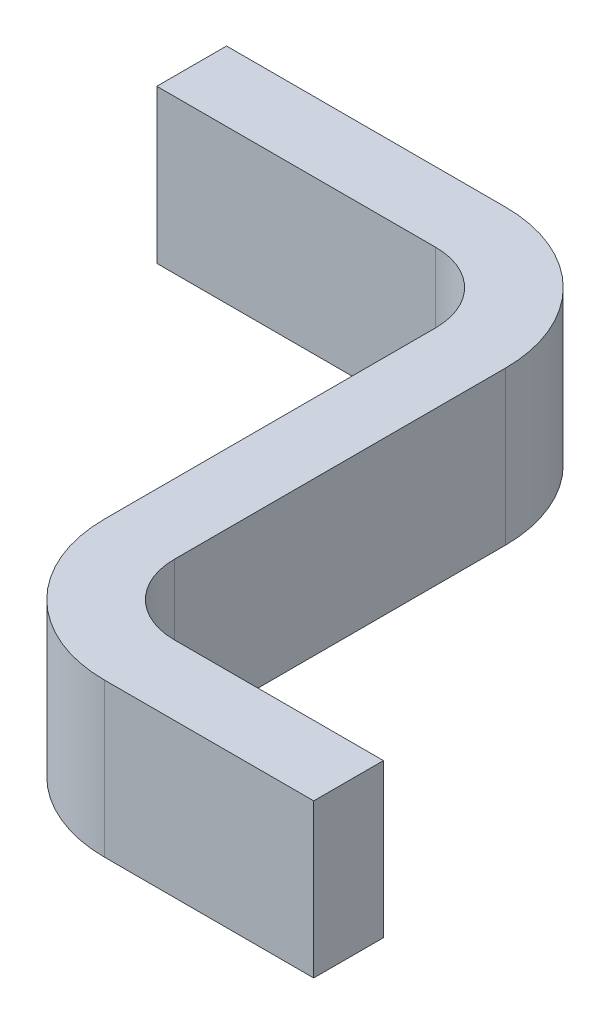
ISO-10303-21;
HEADER;
FILE_DESCRIPTION(('STEP AP214'),'2;1');
FILE_NAME('part.step','',(''),(''),'','','');
FILE_SCHEMA(('AUTOMOTIVE_DESIGN { 1 0 10303 214 1 1 1 1 }'));
ENDSEC;
DATA;
#1=APPLICATION_CONTEXT('core data for automotive mechanical design processes');
#2=APPLICATION_PROTOCOL_DEFINITION('international standard','automotive_design',2000,#1);
#3=PRODUCT_CONTEXT('',#1,'mechanical');
#4=PRODUCT('Part','Part','',(#3));
#5=PRODUCT_RELATED_PRODUCT_CATEGORY('part','',(#4));
#6=PRODUCT_DEFINITION_FORMATION('','',#4);
#7=PRODUCT_DEFINITION_CONTEXT('part definition',#1,'design');
#8=PRODUCT_DEFINITION('design','',#6,#7);
#9=PRODUCT_DEFINITION_SHAPE('','',#8);
#10=(LENGTH_UNIT() NAMED_UNIT(*) SI_UNIT(.MILLI.,.METRE.));
#11=(NAMED_UNIT(*) PLANE_ANGLE_UNIT() SI_UNIT($,.RADIAN.));
#12=(NAMED_UNIT(*) SI_UNIT($,.STERADIAN.) SOLID_ANGLE_UNIT());
#13=UNCERTAINTY_MEASURE_WITH_UNIT(LENGTH_MEASURE(1.E-05),#10,'distance_accuracy_value','');
#14=(GEOMETRIC_REPRESENTATION_CONTEXT(3) GLOBAL_UNCERTAINTY_ASSIGNED_CONTEXT((#13)) GLOBAL_UNIT_ASSIGNED_CONTEXT((#10,
#11,#12)) REPRESENTATION_CONTEXT('',''));
#15=CARTESIAN_POINT('',(0.,0.,0.));
#16=DIRECTION('',(0.,0.,1.));
#17=DIRECTION('',(1.,0.,0.));
#18=AXIS2_PLACEMENT_3D('',#15,#16,#17);
#19=CARTESIAN_POINT('',(-4.,-1.64,0.675));
#20=DIRECTION('',(0.,-1.,0.));
#21=DIRECTION('',(1.,0.,0.));
#22=AXIS2_PLACEMENT_3D('',#19,#20,#21);
#23=PLANE('',#22);
#24=CARTESIAN_POINT('',(-3.8,-1.64,0.675));
#25=DIRECTION('',(0.,1.,0.));
#26=DIRECTION('',(-1.,0.,0.));
#27=AXIS2_PLACEMENT_3D('',#24,#25,#26);
#28=CIRCLE('',#27,0.2);
#29=CARTESIAN_POINT('',(-3.8,-1.64,0.875));
#30=VERTEX_POINT('',#29);
#31=CARTESIAN_POINT('',(-4.,-1.64,0.675));
#32=VERTEX_POINT('',#31);
#33=EDGE_CURVE('E150',#30,#32,#28,.F.);
#34=ORIENTED_EDGE('',*,*,#33,.F.);
#35=DIRECTION('',(-1.,0.,0.));
#36=VECTOR('',#35,1.);
#37=CARTESIAN_POINT('',(-3.50000000000001,-1.64,0.875));
#38=LINE('',#37,#36);
#39=CARTESIAN_POINT('',(-3.50000000000001,-1.64,0.875));
#40=VERTEX_POINT('',#39);
#41=EDGE_CURVE('E147',#30,#40,#38,.F.);
#42=ORIENTED_EDGE('',*,*,#41,.T.);
#43=DIRECTION('',(0.,0.,1.));
#44=VECTOR('',#43,1.);
#45=CARTESIAN_POINT('',(-3.50000000000001,-1.64,0.775));
#46=LINE('',#45,#44);
#47=CARTESIAN_POINT('',(-3.50000000000001,-1.64,0.775));
#48=VERTEX_POINT('',#47);
#49=EDGE_CURVE('E141',#48,#40,#46,.T.);
#50=ORIENTED_EDGE('',*,*,#49,.F.);
#51=DIRECTION('',(1.,0.,0.));
#52=VECTOR('',#51,1.);
#53=CARTESIAN_POINT('',(-3.50000000000001,-1.64,0.775));
#54=LINE('',#53,#52);
#55=CARTESIAN_POINT('',(-3.8,-1.64,0.775));
#56=VERTEX_POINT('',#55);
#57=EDGE_CURVE('E115',#48,#56,#54,.F.);
#58=ORIENTED_EDGE('',*,*,#57,.T.);
#59=CARTESIAN_POINT('',(-3.8,-1.64,0.675));
#60=DIRECTION('',(0.,1.,0.));
#61=DIRECTION('',(-1.,0.,0.));
#62=AXIS2_PLACEMENT_3D('',#59,#60,#61);
#63=CIRCLE('',#62,0.1);
#64=CARTESIAN_POINT('',(-3.90000000000001,-1.64,0.675));
#65=VERTEX_POINT('',#64);
#66=EDGE_CURVE('E215',#56,#65,#63,.F.);
#67=ORIENTED_EDGE('',*,*,#66,.T.);
#68=DIRECTION('',(0.,0.,1.));
#69=VECTOR('',#68,1.);
#70=CARTESIAN_POINT('',(-3.90000000000001,-1.64,0.675));
#71=LINE('',#70,#69);
#72=CARTESIAN_POINT('',(-3.90000000000001,-1.64,0.2));
#73=VERTEX_POINT('',#72);
#74=EDGE_CURVE('E181',#65,#73,#71,.F.);
#75=ORIENTED_EDGE('',*,*,#74,.T.);
#76=CARTESIAN_POINT('',(-4.1,-1.64,0.2));
#77=DIRECTION('',(0.,-1.,0.));
#78=DIRECTION('',(1.,0.,0.));
#79=AXIS2_PLACEMENT_3D('',#76,#77,#78);
#80=CIRCLE('',#79,0.2);
#81=CARTESIAN_POINT('',(-4.1,-1.64,0.));
#82=VERTEX_POINT('',#81);
#83=EDGE_CURVE('E20',#82,#73,#80,.T.);
#84=ORIENTED_EDGE('',*,*,#83,.F.);
#85=DIRECTION('',(1.,0.,0.));
#86=VECTOR('',#85,1.);
#87=CARTESIAN_POINT('',(-4.1,-1.64,0.));
#88=LINE('',#87,#86);
#89=CARTESIAN_POINT('',(-4.5,-1.64,0.));
#90=VERTEX_POINT('',#89);
#91=EDGE_CURVE('E91',#82,#90,#88,.F.);
#92=ORIENTED_EDGE('',*,*,#91,.T.);
#93=DIRECTION('',(0.,0.,1.));
#94=VECTOR('',#93,1.);
#95=CARTESIAN_POINT('',(-4.5,-1.64,0.));
#96=LINE('',#95,#94);
#97=CARTESIAN_POINT('',(-4.5,-1.64,0.1));
#98=VERTEX_POINT('',#97);
#99=EDGE_CURVE('E163',#90,#98,#96,.T.);
#100=ORIENTED_EDGE('',*,*,#99,.T.);
#101=DIRECTION('',(-1.,0.,0.));
#102=VECTOR('',#101,1.);
#103=CARTESIAN_POINT('',(-4.1,-1.64,0.1));
#104=LINE('',#103,#102);
#105=CARTESIAN_POINT('',(-4.1,-1.64,0.1));
#106=VERTEX_POINT('',#105);
#107=EDGE_CURVE('E159',#98,#106,#104,.F.);
#108=ORIENTED_EDGE('',*,*,#107,.T.);
#109=CARTESIAN_POINT('',(-4.1,-1.64,0.2));
#110=DIRECTION('',(0.,-1.,0.));
#111=DIRECTION('',(1.,0.,0.));
#112=AXIS2_PLACEMENT_3D('',#109,#110,#111);
#113=CIRCLE('',#112,0.1);
#114=CARTESIAN_POINT('',(-4.,-1.64,0.2));
#115=VERTEX_POINT('',#114);
#116=EDGE_CURVE('E155',#106,#115,#113,.T.);
#117=ORIENTED_EDGE('',*,*,#116,.T.);
#118=DIRECTION('',(0.,0.,1.));
#119=VECTOR('',#118,1.);
#120=CARTESIAN_POINT('',(-4.,-1.64,0.675));
#121=LINE('',#120,#119);
#122=EDGE_CURVE('E154',#115,#32,#121,.T.);
#123=ORIENTED_EDGE('',*,*,#122,.T.);
#124=EDGE_LOOP('',(#34,#42,#50,#58,#67,#75,#84,#92,#100,#108,#117,#123));
#125=FACE_BOUND('',#124,.T.);
#126=ADVANCED_FACE('F17',(#125),#23,.F.);
#127=CARTESIAN_POINT('',(-4.1,-1.64,0.2));
#128=DIRECTION('',(0.,-1.,0.));
#129=DIRECTION('',(1.,0.,0.));
#130=AXIS2_PLACEMENT_3D('',#127,#128,#129);
#131=CYLINDRICAL_SURFACE('',#130,0.2);
#132=CARTESIAN_POINT('',(-4.1,-1.86,0.2));
#133=DIRECTION('',(0.,-1.,0.));
#134=DIRECTION('',(1.,0.,0.));
#135=AXIS2_PLACEMENT_3D('',#132,#133,#134);
#136=CIRCLE('',#135,0.2);
#137=CARTESIAN_POINT('',(-3.9,-1.86,0.2));
#138=VERTEX_POINT('',#137);
#139=CARTESIAN_POINT('',(-4.1,-1.86,0.));
#140=VERTEX_POINT('',#139);
#141=EDGE_CURVE('E183',#138,#140,#136,.F.);
#142=ORIENTED_EDGE('',*,*,#141,.T.);
#143=DIRECTION('',(0.,1.,0.));
#144=VECTOR('',#143,1.);
#145=CARTESIAN_POINT('',(-4.1,-1.64,0.));
#146=LINE('',#145,#144);
#147=EDGE_CURVE('E178',#140,#82,#146,.T.);
#148=ORIENTED_EDGE('',*,*,#147,.T.);
#149=ORIENTED_EDGE('',*,*,#83,.T.);
#150=DIRECTION('',(0.,-1.,0.));
#151=VECTOR('',#150,1.);
#152=CARTESIAN_POINT('',(-3.90000000000001,-1.64,0.2));
#153=LINE('',#152,#151);
#154=EDGE_CURVE('E217',#73,#138,#153,.T.);
#155=ORIENTED_EDGE('',*,*,#154,.T.);
#156=EDGE_LOOP('',(#142,#148,#149,#155));
#157=FACE_BOUND('',#156,.T.);
#158=ADVANCED_FACE('F254',(#157),#131,.T.);
#159=CARTESIAN_POINT('',(-4.1,-1.64,0.));
#160=DIRECTION('',(0.,0.,1.));
#161=DIRECTION('',(1.,0.,0.));
#162=AXIS2_PLACEMENT_3D('',#159,#160,#161);
#163=PLANE('',#162);
#164=ORIENTED_EDGE('',*,*,#147,.F.);
#165=DIRECTION('',(-1.,0.,0.));
#166=VECTOR('',#165,1.);
#167=CARTESIAN_POINT('',(-3.9,-1.86,0.));
#168=LINE('',#167,#166);
#169=CARTESIAN_POINT('',(-4.5,-1.86,0.));
#170=VERTEX_POINT('',#169);
#171=EDGE_CURVE('E170',#140,#170,#168,.T.);
#172=ORIENTED_EDGE('',*,*,#171,.T.);
#173=DIRECTION('',(0.,1.,0.));
#174=VECTOR('',#173,1.);
#175=CARTESIAN_POINT('',(-4.5,-1.64,0.));
#176=LINE('',#175,#174);
#177=EDGE_CURVE('E173',#170,#90,#176,.T.);
#178=ORIENTED_EDGE('',*,*,#177,.T.);
#179=ORIENTED_EDGE('',*,*,#91,.F.);
#180=EDGE_LOOP('',(#164,#172,#178,#179));
#181=FACE_BOUND('',#180,.T.);
#182=ADVANCED_FACE('F257',(#181),#163,.F.);
#183=CARTESIAN_POINT('',(-4.5,-1.64,0.));
#184=DIRECTION('',(1.,0.,0.));
#185=DIRECTION('',(0.,1.,0.));
#186=AXIS2_PLACEMENT_3D('',#183,#184,#185);
#187=PLANE('',#186);
#188=DIRECTION('',(0.,1.,0.));
#189=VECTOR('',#188,1.);
#190=CARTESIAN_POINT('',(-4.5,-1.86,0.1));
#191=LINE('',#190,#189);
#192=CARTESIAN_POINT('',(-4.5,-1.86,0.1));
#193=VERTEX_POINT('',#192);
#194=EDGE_CURVE('E160',#193,#98,#191,.T.);
#195=ORIENTED_EDGE('',*,*,#194,.T.);
#196=ORIENTED_EDGE('',*,*,#99,.F.);
#197=ORIENTED_EDGE('',*,*,#177,.F.);
#198=DIRECTION('',(0.,0.,1.));
#199=VECTOR('',#198,1.);
#200=CARTESIAN_POINT('',(-4.5,-1.86,0.675));
#201=LINE('',#200,#199);
#202=EDGE_CURVE('E166',#170,#193,#201,.T.);
#203=ORIENTED_EDGE('',*,*,#202,.T.);
#204=EDGE_LOOP('',(#195,#196,#197,#203));
#205=FACE_BOUND('',#204,.T.);
#206=ADVANCED_FACE('F259',(#205),#187,.F.);
#207=CARTESIAN_POINT('',(-4.1,-1.86,0.1));
#208=DIRECTION('',(0.,0.,-1.));
#209=DIRECTION('',(-1.,0.,0.));
#210=AXIS2_PLACEMENT_3D('',#207,#208,#209);
#211=PLANE('',#210);
#212=DIRECTION('',(0.,-1.,0.));
#213=VECTOR('',#212,1.);
#214=CARTESIAN_POINT('',(-4.1,-1.86,0.1));
#215=LINE('',#214,#213);
#216=CARTESIAN_POINT('',(-4.1,-1.86,0.1));
#217=VERTEX_POINT('',#216);
#218=EDGE_CURVE('E156',#217,#106,#215,.F.);
#219=ORIENTED_EDGE('',*,*,#218,.T.);
#220=ORIENTED_EDGE('',*,*,#107,.F.);
#221=ORIENTED_EDGE('',*,*,#194,.F.);
#222=DIRECTION('',(-1.,0.,0.));
#223=VECTOR('',#222,1.);
#224=CARTESIAN_POINT('',(-3.9,-1.86,0.1));
#225=LINE('',#224,#223);
#226=EDGE_CURVE('E169',#193,#217,#225,.F.);
#227=ORIENTED_EDGE('',*,*,#226,.T.);
#228=EDGE_LOOP('',(#219,#220,#221,#227));
#229=FACE_BOUND('',#228,.T.);
#230=ADVANCED_FACE('F234',(#229),#211,.F.);
#231=CARTESIAN_POINT('',(-4.1,-1.86,0.2));
#232=DIRECTION('',(0.,-1.,0.));
#233=DIRECTION('',(1.,0.,0.));
#234=AXIS2_PLACEMENT_3D('',#231,#232,#233);
#235=CYLINDRICAL_SURFACE('',#234,0.1);
#236=DIRECTION('',(0.,1.,0.));
#237=VECTOR('',#236,1.);
#238=CARTESIAN_POINT('',(-4.,-1.86,0.2));
#239=LINE('',#238,#237);
#240=CARTESIAN_POINT('',(-4.,-1.86,0.2));
#241=VERTEX_POINT('',#240);
#242=EDGE_CURVE('E151',#241,#115,#239,.T.);
#243=ORIENTED_EDGE('',*,*,#242,.T.);
#244=ORIENTED_EDGE('',*,*,#116,.F.);
#245=ORIENTED_EDGE('',*,*,#218,.F.);
#246=CARTESIAN_POINT('',(-4.1,-1.86,0.2));
#247=DIRECTION('',(0.,-1.,0.));
#248=DIRECTION('',(1.,0.,0.));
#249=AXIS2_PLACEMENT_3D('',#246,#247,#248);
#250=CIRCLE('',#249,0.1);
#251=EDGE_CURVE('E210',#217,#241,#250,.T.);
#252=ORIENTED_EDGE('',*,*,#251,.T.);
#253=EDGE_LOOP('',(#243,#244,#245,#252));
#254=FACE_BOUND('',#253,.T.);
#255=ADVANCED_FACE('F227',(#254),#235,.F.);
#256=CARTESIAN_POINT('',(-4.,-1.86,0.675));
#257=DIRECTION('',(1.,0.,0.));
#258=DIRECTION('',(0.,1.,0.));
#259=AXIS2_PLACEMENT_3D('',#256,#257,#258);
#260=PLANE('',#259);
#261=DIRECTION('',(0.,1.,0.));
#262=VECTOR('',#261,1.);
#263=CARTESIAN_POINT('',(-4.,-1.86,0.675));
#264=LINE('',#263,#262);
#265=CARTESIAN_POINT('',(-4.,-1.86,0.675));
#266=VERTEX_POINT('',#265);
#267=EDGE_CURVE('E148',#32,#266,#264,.F.);
#268=ORIENTED_EDGE('',*,*,#267,.F.);
#269=ORIENTED_EDGE('',*,*,#122,.F.);
#270=ORIENTED_EDGE('',*,*,#242,.F.);
#271=DIRECTION('',(0.,0.,1.));
#272=VECTOR('',#271,1.);
#273=CARTESIAN_POINT('',(-4.,-1.86,0.675));
#274=LINE('',#273,#272);
#275=EDGE_CURVE('E209',#241,#266,#274,.T.);
#276=ORIENTED_EDGE('',*,*,#275,.T.);
#277=EDGE_LOOP('',(#268,#269,#270,#276));
#278=FACE_BOUND('',#277,.T.);
#279=ADVANCED_FACE('F224',(#278),#260,.F.);
#280=CARTESIAN_POINT('',(-3.8,-1.86,0.675));
#281=DIRECTION('',(0.,1.,0.));
#282=DIRECTION('',(-1.,0.,0.));
#283=AXIS2_PLACEMENT_3D('',#280,#281,#282);
#284=CYLINDRICAL_SURFACE('',#283,0.2);
#285=ORIENTED_EDGE('',*,*,#33,.T.);
#286=ORIENTED_EDGE('',*,*,#267,.T.);
#287=CARTESIAN_POINT('',(-3.8,-1.86,0.675));
#288=DIRECTION('',(0.,1.,0.));
#289=DIRECTION('',(-1.,0.,0.));
#290=AXIS2_PLACEMENT_3D('',#287,#288,#289);
#291=CIRCLE('',#290,0.2);
#292=CARTESIAN_POINT('',(-3.8,-1.86,0.875));
#293=VERTEX_POINT('',#292);
#294=EDGE_CURVE('E133',#266,#293,#291,.T.);
#295=ORIENTED_EDGE('',*,*,#294,.T.);
#296=DIRECTION('',(0.,1.,0.));
#297=VECTOR('',#296,1.);
#298=CARTESIAN_POINT('',(-3.8,-1.86,0.875));
#299=LINE('',#298,#297);
#300=EDGE_CURVE('E144',#293,#30,#299,.T.);
#301=ORIENTED_EDGE('',*,*,#300,.T.);
#302=EDGE_LOOP('',(#285,#286,#295,#301));
#303=FACE_BOUND('',#302,.T.);
#304=ADVANCED_FACE('F285',(#303),#284,.T.);
#305=CARTESIAN_POINT('',(-3.50000000000001,-1.86,0.875));
#306=DIRECTION('',(0.,0.,-1.));
#307=DIRECTION('',(-1.,0.,0.));
#308=AXIS2_PLACEMENT_3D('',#305,#306,#307);
#309=PLANE('',#308);
#310=DIRECTION('',(0.,1.,0.));
#311=VECTOR('',#310,1.);
#312=CARTESIAN_POINT('',(-3.50000000000001,-1.64,0.875));
#313=LINE('',#312,#311);
#314=CARTESIAN_POINT('',(-3.50000000000001,-1.86,0.875));
#315=VERTEX_POINT('',#314);
#316=EDGE_CURVE('E118',#40,#315,#313,.F.);
#317=ORIENTED_EDGE('',*,*,#316,.F.);
#318=ORIENTED_EDGE('',*,*,#41,.F.);
#319=ORIENTED_EDGE('',*,*,#300,.F.);
#320=DIRECTION('',(-1.,0.,0.));
#321=VECTOR('',#320,1.);
#322=CARTESIAN_POINT('',(-3.9,-1.86,0.875));
#323=LINE('',#322,#321);
#324=EDGE_CURVE('E131',#293,#315,#323,.F.);
#325=ORIENTED_EDGE('',*,*,#324,.T.);
#326=EDGE_LOOP('',(#317,#318,#319,#325));
#327=FACE_BOUND('',#326,.T.);
#328=ADVANCED_FACE('F282',(#327),#309,.F.);
#329=CARTESIAN_POINT('',(-3.50000000000001,-1.64,0.775));
#330=DIRECTION('',(1.,0.,0.));
#331=DIRECTION('',(0.,1.,0.));
#332=AXIS2_PLACEMENT_3D('',#329,#330,#331);
#333=PLANE('',#332);
#334=ORIENTED_EDGE('',*,*,#49,.T.);
#335=ORIENTED_EDGE('',*,*,#316,.T.);
#336=DIRECTION('',(0.,0.,1.));
#337=VECTOR('',#336,1.);
#338=CARTESIAN_POINT('',(-3.50000000000001,-1.86,0.675));
#339=LINE('',#338,#337);
#340=CARTESIAN_POINT('',(-3.50000000000001,-1.86,0.775));
#341=VERTEX_POINT('',#340);
#342=EDGE_CURVE('E125',#315,#341,#339,.F.);
#343=ORIENTED_EDGE('',*,*,#342,.T.);
#344=DIRECTION('',(0.,1.,0.));
#345=VECTOR('',#344,1.);
#346=CARTESIAN_POINT('',(-3.50000000000001,-1.64,0.775));
#347=LINE('',#346,#345);
#348=EDGE_CURVE('E110',#341,#48,#347,.T.);
#349=ORIENTED_EDGE('',*,*,#348,.T.);
#350=EDGE_LOOP('',(#334,#335,#343,#349));
#351=FACE_BOUND('',#350,.T.);
#352=ADVANCED_FACE('F129',(#351),#333,.T.);
#353=CARTESIAN_POINT('',(-3.50000000000001,-1.64,0.775));
#354=DIRECTION('',(0.,0.,1.));
#355=DIRECTION('',(1.,0.,0.));
#356=AXIS2_PLACEMENT_3D('',#353,#354,#355);
#357=PLANE('',#356);
#358=ORIENTED_EDGE('',*,*,#348,.F.);
#359=DIRECTION('',(-1.,0.,0.));
#360=VECTOR('',#359,1.);
#361=CARTESIAN_POINT('',(-3.9,-1.86,0.775));
#362=LINE('',#361,#360);
#363=CARTESIAN_POINT('',(-3.8,-1.86,0.775));
#364=VERTEX_POINT('',#363);
#365=EDGE_CURVE('E114',#341,#364,#362,.T.);
#366=ORIENTED_EDGE('',*,*,#365,.T.);
#367=DIRECTION('',(0.,1.,0.));
#368=VECTOR('',#367,1.);
#369=CARTESIAN_POINT('',(-3.8,-1.64,0.775));
#370=LINE('',#369,#368);
#371=EDGE_CURVE('E185',#364,#56,#370,.T.);
#372=ORIENTED_EDGE('',*,*,#371,.T.);
#373=ORIENTED_EDGE('',*,*,#57,.F.);
#374=EDGE_LOOP('',(#358,#366,#372,#373));
#375=FACE_BOUND('',#374,.T.);
#376=ADVANCED_FACE('F112',(#375),#357,.F.);
#377=CARTESIAN_POINT('',(-3.8,-1.64,0.675));
#378=DIRECTION('',(0.,1.,0.));
#379=DIRECTION('',(-1.,0.,0.));
#380=AXIS2_PLACEMENT_3D('',#377,#378,#379);
#381=CYLINDRICAL_SURFACE('',#380,0.1);
#382=ORIENTED_EDGE('',*,*,#371,.F.);
#383=CARTESIAN_POINT('',(-3.8,-1.86,0.675));
#384=DIRECTION('',(0.,1.,0.));
#385=DIRECTION('',(-1.,0.,0.));
#386=AXIS2_PLACEMENT_3D('',#383,#384,#385);
#387=CIRCLE('',#386,0.1);
#388=CARTESIAN_POINT('',(-3.9,-1.86,0.675));
#389=VERTEX_POINT('',#388);
#390=EDGE_CURVE('E26',#364,#389,#387,.F.);
#391=ORIENTED_EDGE('',*,*,#390,.T.);
#392=DIRECTION('',(0.,-1.,0.));
#393=VECTOR('',#392,1.);
#394=CARTESIAN_POINT('',(-3.90000000000001,-1.64,0.675));
#395=LINE('',#394,#393);
#396=EDGE_CURVE('E34',#389,#65,#395,.F.);
#397=ORIENTED_EDGE('',*,*,#396,.T.);
#398=ORIENTED_EDGE('',*,*,#66,.F.);
#399=EDGE_LOOP('',(#382,#391,#397,#398));
#400=FACE_BOUND('',#399,.T.);
#401=ADVANCED_FACE('F250',(#400),#381,.F.);
#402=CARTESIAN_POINT('',(-3.90000000000001,-1.64,0.675));
#403=DIRECTION('',(-1.,0.,0.));
#404=DIRECTION('',(0.,-1.,0.));
#405=AXIS2_PLACEMENT_3D('',#402,#403,#404);
#406=PLANE('',#405);
#407=ORIENTED_EDGE('',*,*,#396,.F.);
#408=DIRECTION('',(0.,0.,1.));
#409=VECTOR('',#408,1.);
#410=CARTESIAN_POINT('',(-3.9,-1.86,0.675));
#411=LINE('',#410,#409);
#412=EDGE_CURVE('E11',#389,#138,#411,.F.);
#413=ORIENTED_EDGE('',*,*,#412,.T.);
#414=ORIENTED_EDGE('',*,*,#154,.F.);
#415=ORIENTED_EDGE('',*,*,#74,.F.);
#416=EDGE_LOOP('',(#407,#413,#414,#415));
#417=FACE_BOUND('',#416,.T.);
#418=ADVANCED_FACE('F252',(#417),#406,.F.);
#419=CARTESIAN_POINT('',(-3.9,-1.86,0.675));
#420=DIRECTION('',(0.,1.,0.));
#421=DIRECTION('',(-1.,0.,0.));
#422=AXIS2_PLACEMENT_3D('',#419,#420,#421);
#423=PLANE('',#422);
#424=ORIENTED_EDGE('',*,*,#390,.F.);
#425=ORIENTED_EDGE('',*,*,#365,.F.);
#426=ORIENTED_EDGE('',*,*,#342,.F.);
#427=ORIENTED_EDGE('',*,*,#324,.F.);
#428=ORIENTED_EDGE('',*,*,#294,.F.);
#429=ORIENTED_EDGE('',*,*,#275,.F.);
#430=ORIENTED_EDGE('',*,*,#251,.F.);
#431=ORIENTED_EDGE('',*,*,#226,.F.);
#432=ORIENTED_EDGE('',*,*,#202,.F.);
#433=ORIENTED_EDGE('',*,*,#171,.F.);
#434=ORIENTED_EDGE('',*,*,#141,.F.);
#435=ORIENTED_EDGE('',*,*,#412,.F.);
#436=EDGE_LOOP('',(#424,#425,#426,#427,#428,#429,#430,#431,#432,#433,#434,#435));
#437=FACE_BOUND('',#436,.T.);
#438=ADVANCED_FACE('F123',(#437),#423,.F.);
#439=CLOSED_SHELL('',(#126,#158,#182,#206,#230,#255,#279,#304,#328,#352,#376,#401,#418,#438));
#440=MANIFOLD_SOLID_BREP('B1',#439);
#441=ADVANCED_BREP_SHAPE_REPRESENTATION('',(#18,#440),#14);
#442=SHAPE_DEFINITION_REPRESENTATION(#9,#441);
ENDSEC;
END-ISO-10303-21;
